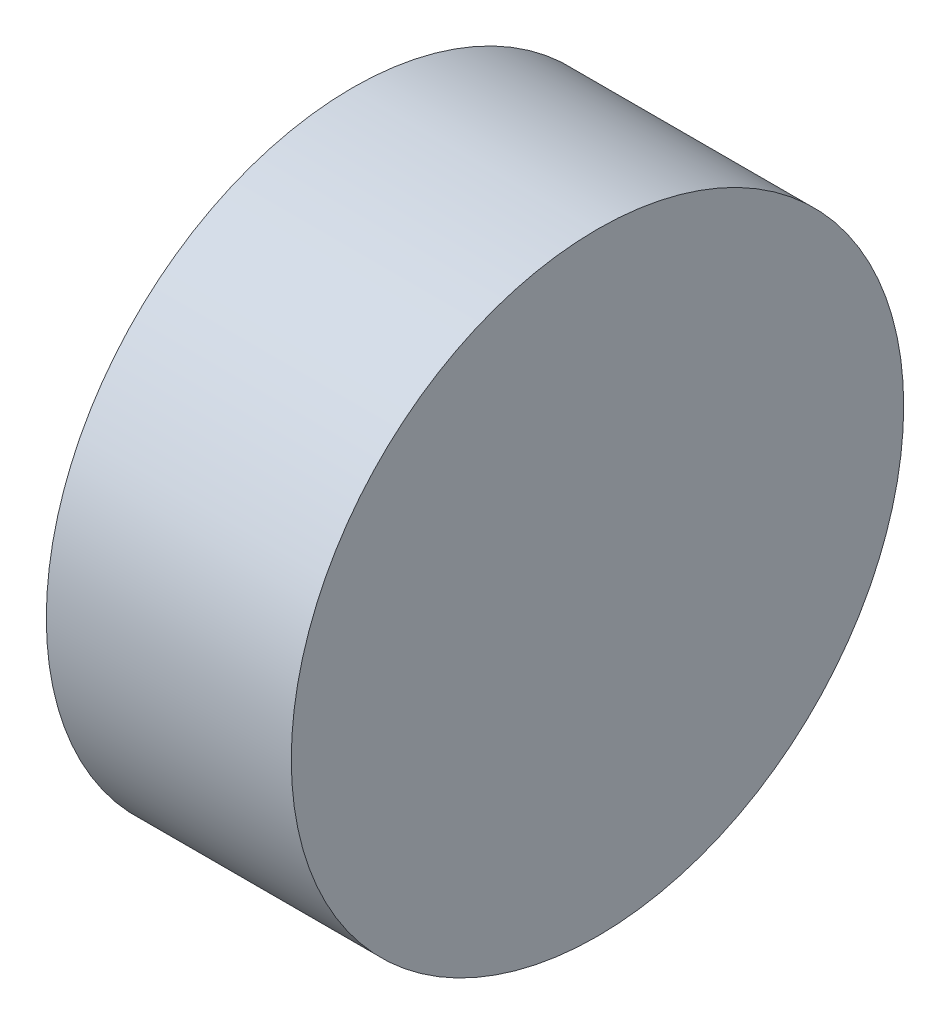
ISO-10303-21;
HEADER;
FILE_DESCRIPTION(('STEP AP214'),'2;1');
FILE_NAME('part.step','',(''),(''),'','','');
FILE_SCHEMA(('AUTOMOTIVE_DESIGN { 1 0 10303 214 1 1 1 1 }'));
ENDSEC;
DATA;
#1=APPLICATION_CONTEXT('core data for automotive mechanical design processes');
#2=APPLICATION_PROTOCOL_DEFINITION('international standard','automotive_design',2000,#1);
#3=PRODUCT_CONTEXT('',#1,'mechanical');
#4=PRODUCT('Part','Part','',(#3));
#5=PRODUCT_RELATED_PRODUCT_CATEGORY('part','',(#4));
#6=PRODUCT_DEFINITION_FORMATION('','',#4);
#7=PRODUCT_DEFINITION_CONTEXT('part definition',#1,'design');
#8=PRODUCT_DEFINITION('design','',#6,#7);
#9=PRODUCT_DEFINITION_SHAPE('','',#8);
#10=(LENGTH_UNIT() NAMED_UNIT(*) SI_UNIT(.MILLI.,.METRE.));
#11=(NAMED_UNIT(*) PLANE_ANGLE_UNIT() SI_UNIT($,.RADIAN.));
#12=(NAMED_UNIT(*) SI_UNIT($,.STERADIAN.) SOLID_ANGLE_UNIT());
#13=UNCERTAINTY_MEASURE_WITH_UNIT(LENGTH_MEASURE(1.E-05),#10,'distance_accuracy_value','');
#14=(GEOMETRIC_REPRESENTATION_CONTEXT(3) GLOBAL_UNCERTAINTY_ASSIGNED_CONTEXT((#13)) GLOBAL_UNIT_ASSIGNED_CONTEXT((#10,
#11,#12)) REPRESENTATION_CONTEXT('',''));
#15=CARTESIAN_POINT('',(0.,0.,0.));
#16=DIRECTION('',(0.,0.,1.));
#17=DIRECTION('',(1.,0.,0.));
#18=AXIS2_PLACEMENT_3D('',#15,#16,#17);
#19=CARTESIAN_POINT('',(54.0314280985122,17.9586358698031,0.));
#20=DIRECTION('',(-1.,0.,0.));
#21=DIRECTION('',(0.,0.,1.));
#22=AXIS2_PLACEMENT_3D('',#19,#20,#21);
#23=PLANE('',#22);
#24=CARTESIAN_POINT('',(54.0314280985122,15.4586358698031,0.));
#25=DIRECTION('',(-1.,0.,0.));
#26=DIRECTION('',(0.,0.,1.));
#27=AXIS2_PLACEMENT_3D('',#24,#25,#26);
#28=CIRCLE('',#27,2.5);
#29=CARTESIAN_POINT('',(54.0314280985122,15.4586358698031,2.5));
#30=VERTEX_POINT('',#29);
#31=EDGE_CURVE('E41',#30,#30,#28,.T.);
#32=ORIENTED_EDGE('',*,*,#31,.F.);
#33=EDGE_LOOP('',(#32));
#34=FACE_BOUND('',#33,.T.);
#35=ADVANCED_FACE('F35',(#34),#23,.F.);
#36=CARTESIAN_POINT('',(52.0314280985122,15.4586358698031,0.));
#37=DIRECTION('',(1.,0.,0.));
#38=DIRECTION('',(0.,0.,-1.));
#39=AXIS2_PLACEMENT_3D('',#36,#37,#38);
#40=PLANE('',#39);
#41=CARTESIAN_POINT('',(52.0314280985122,15.4586358698031,0.));
#42=DIRECTION('',(-1.,0.,0.));
#43=DIRECTION('',(0.,0.,1.));
#44=AXIS2_PLACEMENT_3D('',#41,#42,#43);
#45=CIRCLE('',#44,2.5);
#46=CARTESIAN_POINT('',(52.0314280985122,15.4586358698031,2.5));
#47=VERTEX_POINT('',#46);
#48=EDGE_CURVE('E10',#47,#47,#45,.T.);
#49=ORIENTED_EDGE('',*,*,#48,.T.);
#50=EDGE_LOOP('',(#49));
#51=FACE_BOUND('',#50,.T.);
#52=ADVANCED_FACE('F50',(#51),#40,.F.);
#53=CARTESIAN_POINT('',(50.8001603985232,15.4586358698031,0.));
#54=DIRECTION('',(-1.,0.,0.));
#55=DIRECTION('',(0.,0.,1.));
#56=AXIS2_PLACEMENT_3D('',#53,#54,#55);
#57=CYLINDRICAL_SURFACE('',#56,2.5);
#58=ORIENTED_EDGE('',*,*,#48,.F.);
#59=EDGE_LOOP('',(#58));
#60=FACE_BOUND('',#59,.T.);
#61=ORIENTED_EDGE('',*,*,#31,.T.);
#62=EDGE_LOOP('',(#61));
#63=FACE_BOUND('',#62,.T.);
#64=ADVANCED_FACE('F47',(#60,#63),#57,.T.);
#65=CLOSED_SHELL('',(#35,#52,#64));
#66=MANIFOLD_SOLID_BREP('B2',#65);
#67=ADVANCED_BREP_SHAPE_REPRESENTATION('',(#18,#66),#14);
#68=SHAPE_DEFINITION_REPRESENTATION(#9,#67);
ENDSEC;
END-ISO-10303-21;
